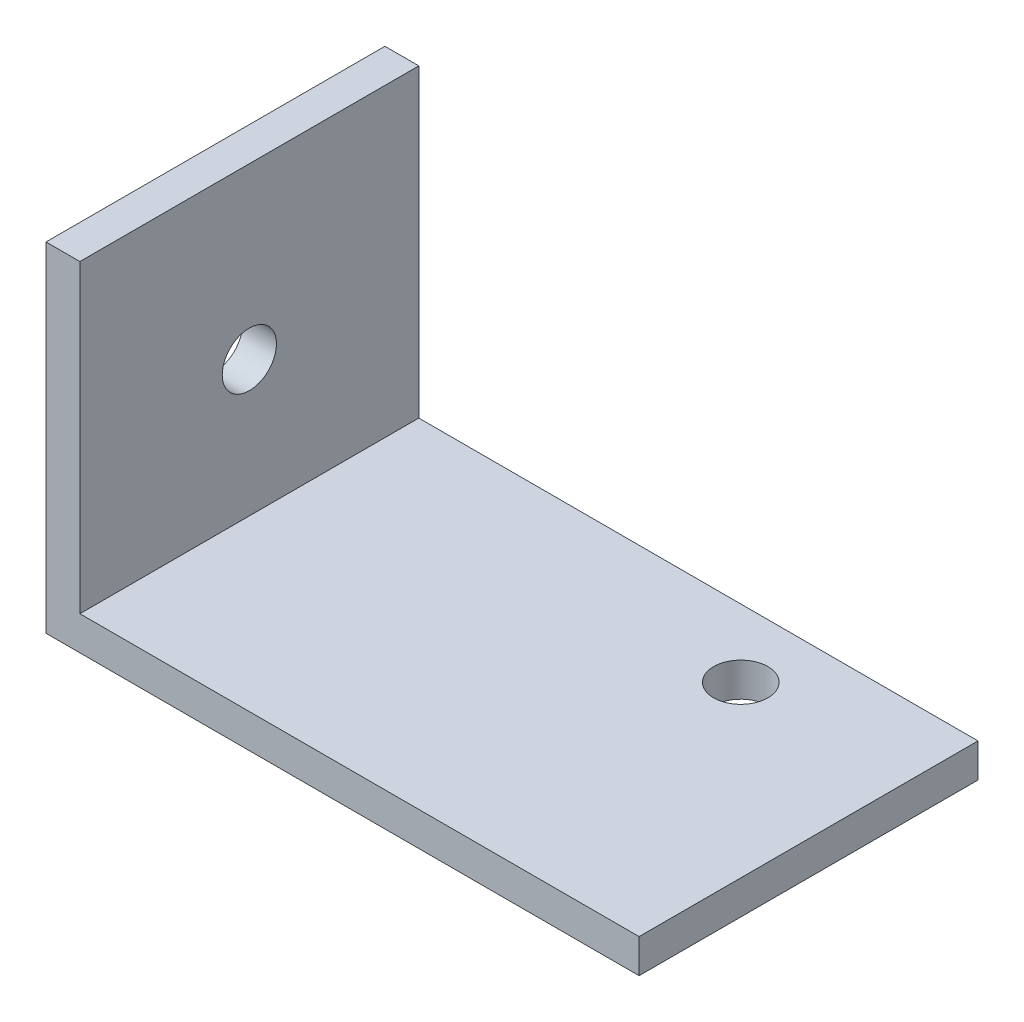
ISO-10303-21;
HEADER;
FILE_DESCRIPTION(('STEP AP214'),'2;1');
FILE_NAME('part.step','',(''),(''),'','','');
FILE_SCHEMA(('AUTOMOTIVE_DESIGN { 1 0 10303 214 1 1 1 1 }'));
ENDSEC;
DATA;
#1=APPLICATION_CONTEXT('core data for automotive mechanical design processes');
#2=APPLICATION_PROTOCOL_DEFINITION('international standard','automotive_design',2000,#1);
#3=PRODUCT_CONTEXT('',#1,'mechanical');
#4=PRODUCT('Part','Part','',(#3));
#5=PRODUCT_RELATED_PRODUCT_CATEGORY('part','',(#4));
#6=PRODUCT_DEFINITION_FORMATION('','',#4);
#7=PRODUCT_DEFINITION_CONTEXT('part definition',#1,'design');
#8=PRODUCT_DEFINITION('design','',#6,#7);
#9=PRODUCT_DEFINITION_SHAPE('','',#8);
#10=(LENGTH_UNIT() NAMED_UNIT(*) SI_UNIT(.MILLI.,.METRE.));
#11=(NAMED_UNIT(*) PLANE_ANGLE_UNIT() SI_UNIT($,.RADIAN.));
#12=(NAMED_UNIT(*) SI_UNIT($,.STERADIAN.) SOLID_ANGLE_UNIT());
#13=UNCERTAINTY_MEASURE_WITH_UNIT(LENGTH_MEASURE(1.E-05),#10,'distance_accuracy_value','');
#14=(GEOMETRIC_REPRESENTATION_CONTEXT(3) GLOBAL_UNCERTAINTY_ASSIGNED_CONTEXT((#13)) GLOBAL_UNIT_ASSIGNED_CONTEXT((#10,
#11,#12)) REPRESENTATION_CONTEXT('',''));
#15=CARTESIAN_POINT('',(0.,0.,0.));
#16=DIRECTION('',(0.,0.,1.));
#17=DIRECTION('',(1.,0.,0.));
#18=AXIS2_PLACEMENT_3D('',#15,#16,#17);
#19=CARTESIAN_POINT('',(0.,20.,20.));
#20=DIRECTION('',(1.,0.,0.));
#21=DIRECTION('',(0.,1.,0.));
#22=AXIS2_PLACEMENT_3D('',#19,#20,#21);
#23=PLANE('',#22);
#24=CARTESIAN_POINT('',(0.,10.,10.));
#25=DIRECTION('',(-1.,0.,0.));
#26=DIRECTION('',(0.,-1.,0.));
#27=AXIS2_PLACEMENT_3D('',#24,#25,#26);
#28=CIRCLE('',#27,1.6);
#29=CARTESIAN_POINT('',(0.,8.4,10.));
#30=VERTEX_POINT('',#29);
#31=EDGE_CURVE('E147',#30,#30,#28,.T.);
#32=ORIENTED_EDGE('',*,*,#31,.F.);
#33=EDGE_LOOP('',(#32));
#34=FACE_BOUND('',#33,.T.);
#35=DIRECTION('',(0.,-1.,0.));
#36=VECTOR('',#35,1.);
#37=CARTESIAN_POINT('',(0.,20.,0.));
#38=LINE('',#37,#36);
#39=CARTESIAN_POINT('',(0.,20.,0.));
#40=VERTEX_POINT('',#39);
#41=CARTESIAN_POINT('',(0.,0.,0.));
#42=VERTEX_POINT('',#41);
#43=EDGE_CURVE('E122',#40,#42,#38,.T.);
#44=ORIENTED_EDGE('',*,*,#43,.T.);
#45=DIRECTION('',(0.,0.,-1.));
#46=VECTOR('',#45,1.);
#47=CARTESIAN_POINT('',(0.,0.,20.));
#48=LINE('',#47,#46);
#49=CARTESIAN_POINT('',(0.,0.,20.));
#50=VERTEX_POINT('',#49);
#51=EDGE_CURVE('E11',#50,#42,#48,.T.);
#52=ORIENTED_EDGE('',*,*,#51,.F.);
#53=DIRECTION('',(0.,-1.,0.));
#54=VECTOR('',#53,1.);
#55=CARTESIAN_POINT('',(0.,20.,20.));
#56=LINE('',#55,#54);
#57=CARTESIAN_POINT('',(0.,20.,20.));
#58=VERTEX_POINT('',#57);
#59=EDGE_CURVE('E133',#58,#50,#56,.T.);
#60=ORIENTED_EDGE('',*,*,#59,.F.);
#61=DIRECTION('',(0.,0.,-1.));
#62=VECTOR('',#61,1.);
#63=CARTESIAN_POINT('',(0.,20.,20.));
#64=LINE('',#63,#62);
#65=EDGE_CURVE('E118',#58,#40,#64,.T.);
#66=ORIENTED_EDGE('',*,*,#65,.T.);
#67=EDGE_LOOP('',(#44,#52,#60,#66));
#68=FACE_BOUND('',#67,.T.);
#69=ADVANCED_FACE('F36',(#34,#68),#23,.F.);
#70=CARTESIAN_POINT('',(0.,0.,20.));
#71=DIRECTION('',(0.,1.,0.));
#72=DIRECTION('',(0.,0.,1.));
#73=AXIS2_PLACEMENT_3D('',#70,#71,#72);
#74=PLANE('',#73);
#75=CARTESIAN_POINT('',(25.,0.,4.));
#76=DIRECTION('',(0.,-1.,0.));
#77=DIRECTION('',(0.,0.,-1.));
#78=AXIS2_PLACEMENT_3D('',#75,#76,#77);
#79=CIRCLE('',#78,1.6);
#80=CARTESIAN_POINT('',(25.,0.,2.4));
#81=VERTEX_POINT('',#80);
#82=EDGE_CURVE('E139',#81,#81,#79,.T.);
#83=ORIENTED_EDGE('',*,*,#82,.F.);
#84=EDGE_LOOP('',(#83));
#85=FACE_BOUND('',#84,.T.);
#86=DIRECTION('',(1.,0.,0.));
#87=VECTOR('',#86,1.);
#88=CARTESIAN_POINT('',(0.,0.,0.));
#89=LINE('',#88,#87);
#90=CARTESIAN_POINT('',(35.,0.,0.));
#91=VERTEX_POINT('',#90);
#92=EDGE_CURVE('E125',#42,#91,#89,.T.);
#93=ORIENTED_EDGE('',*,*,#92,.T.);
#94=DIRECTION('',(0.,0.,-1.));
#95=VECTOR('',#94,1.);
#96=CARTESIAN_POINT('',(35.,0.,20.));
#97=LINE('',#96,#95);
#98=CARTESIAN_POINT('',(35.,0.,20.));
#99=VERTEX_POINT('',#98);
#100=EDGE_CURVE('E45',#99,#91,#97,.T.);
#101=ORIENTED_EDGE('',*,*,#100,.F.);
#102=DIRECTION('',(1.,0.,0.));
#103=VECTOR('',#102,1.);
#104=CARTESIAN_POINT('',(0.,0.,20.));
#105=LINE('',#104,#103);
#106=EDGE_CURVE('E91',#50,#99,#105,.T.);
#107=ORIENTED_EDGE('',*,*,#106,.F.);
#108=ORIENTED_EDGE('',*,*,#51,.T.);
#109=EDGE_LOOP('',(#93,#101,#107,#108));
#110=FACE_BOUND('',#109,.T.);
#111=ADVANCED_FACE('F153',(#85,#110),#74,.F.);
#112=CARTESIAN_POINT('',(35.,0.,20.));
#113=DIRECTION('',(-1.,0.,0.));
#114=DIRECTION('',(0.,0.,1.));
#115=AXIS2_PLACEMENT_3D('',#112,#113,#114);
#116=PLANE('',#115);
#117=DIRECTION('',(0.,1.,0.));
#118=VECTOR('',#117,1.);
#119=CARTESIAN_POINT('',(35.,0.,0.));
#120=LINE('',#119,#118);
#121=CARTESIAN_POINT('',(35.,2.,0.));
#122=VERTEX_POINT('',#121);
#123=EDGE_CURVE('E128',#91,#122,#120,.T.);
#124=ORIENTED_EDGE('',*,*,#123,.T.);
#125=DIRECTION('',(0.,0.,-1.));
#126=VECTOR('',#125,1.);
#127=CARTESIAN_POINT('',(35.,2.,20.));
#128=LINE('',#127,#126);
#129=CARTESIAN_POINT('',(35.,2.,20.));
#130=VERTEX_POINT('',#129);
#131=EDGE_CURVE('E113',#130,#122,#128,.T.);
#132=ORIENTED_EDGE('',*,*,#131,.F.);
#133=DIRECTION('',(0.,1.,0.));
#134=VECTOR('',#133,1.);
#135=CARTESIAN_POINT('',(35.,0.,20.));
#136=LINE('',#135,#134);
#137=EDGE_CURVE('E104',#99,#130,#136,.T.);
#138=ORIENTED_EDGE('',*,*,#137,.F.);
#139=ORIENTED_EDGE('',*,*,#100,.T.);
#140=EDGE_LOOP('',(#124,#132,#138,#139));
#141=FACE_BOUND('',#140,.T.);
#142=ADVANCED_FACE('F156',(#141),#116,.F.);
#143=CARTESIAN_POINT('',(35.,2.,20.));
#144=DIRECTION('',(0.,-1.,0.));
#145=DIRECTION('',(1.,0.,0.));
#146=AXIS2_PLACEMENT_3D('',#143,#144,#145);
#147=PLANE('',#146);
#148=CARTESIAN_POINT('',(25.,2.,4.));
#149=DIRECTION('',(0.,-1.,0.));
#150=DIRECTION('',(1.,0.,0.));
#151=AXIS2_PLACEMENT_3D('',#148,#149,#150);
#152=CIRCLE('',#151,1.6);
#153=CARTESIAN_POINT('',(26.6,2.,4.));
#154=VERTEX_POINT('',#153);
#155=EDGE_CURVE('E126',#154,#154,#152,.T.);
#156=ORIENTED_EDGE('',*,*,#155,.T.);
#157=EDGE_LOOP('',(#156));
#158=FACE_BOUND('',#157,.T.);
#159=DIRECTION('',(-1.,0.,0.));
#160=VECTOR('',#159,1.);
#161=CARTESIAN_POINT('',(35.,2.,0.));
#162=LINE('',#161,#160);
#163=CARTESIAN_POINT('',(2.,2.,0.));
#164=VERTEX_POINT('',#163);
#165=EDGE_CURVE('E112',#122,#164,#162,.T.);
#166=ORIENTED_EDGE('',*,*,#165,.T.);
#167=DIRECTION('',(0.,0.,-1.));
#168=VECTOR('',#167,1.);
#169=CARTESIAN_POINT('',(2.,2.,20.));
#170=LINE('',#169,#168);
#171=CARTESIAN_POINT('',(2.,2.,20.));
#172=VERTEX_POINT('',#171);
#173=EDGE_CURVE('E109',#172,#164,#170,.T.);
#174=ORIENTED_EDGE('',*,*,#173,.F.);
#175=DIRECTION('',(-1.,0.,0.));
#176=VECTOR('',#175,1.);
#177=CARTESIAN_POINT('',(35.,2.,20.));
#178=LINE('',#177,#176);
#179=EDGE_CURVE('E98',#130,#172,#178,.T.);
#180=ORIENTED_EDGE('',*,*,#179,.F.);
#181=ORIENTED_EDGE('',*,*,#131,.T.);
#182=EDGE_LOOP('',(#166,#174,#180,#181));
#183=FACE_BOUND('',#182,.T.);
#184=ADVANCED_FACE('F110',(#158,#183),#147,.F.);
#185=CARTESIAN_POINT('',(2.,2.,20.));
#186=DIRECTION('',(-1.,0.,0.));
#187=DIRECTION('',(0.,0.,1.));
#188=AXIS2_PLACEMENT_3D('',#185,#186,#187);
#189=PLANE('',#188);
#190=CARTESIAN_POINT('',(2.,10.,10.));
#191=DIRECTION('',(-1.,0.,0.));
#192=DIRECTION('',(0.,0.,1.));
#193=AXIS2_PLACEMENT_3D('',#190,#191,#192);
#194=CIRCLE('',#193,1.6);
#195=CARTESIAN_POINT('',(2.,10.,11.6));
#196=VERTEX_POINT('',#195);
#197=EDGE_CURVE('E39',#196,#196,#194,.T.);
#198=ORIENTED_EDGE('',*,*,#197,.T.);
#199=EDGE_LOOP('',(#198));
#200=FACE_BOUND('',#199,.T.);
#201=DIRECTION('',(0.,1.,0.));
#202=VECTOR('',#201,1.);
#203=CARTESIAN_POINT('',(2.,2.,0.));
#204=LINE('',#203,#202);
#205=CARTESIAN_POINT('',(2.,20.,0.));
#206=VERTEX_POINT('',#205);
#207=EDGE_CURVE('E77',#164,#206,#204,.T.);
#208=ORIENTED_EDGE('',*,*,#207,.T.);
#209=DIRECTION('',(0.,0.,-1.));
#210=VECTOR('',#209,1.);
#211=CARTESIAN_POINT('',(2.,20.,20.));
#212=LINE('',#211,#210);
#213=CARTESIAN_POINT('',(2.,20.,20.));
#214=VERTEX_POINT('',#213);
#215=EDGE_CURVE('E114',#214,#206,#212,.T.);
#216=ORIENTED_EDGE('',*,*,#215,.F.);
#217=DIRECTION('',(0.,1.,0.));
#218=VECTOR('',#217,1.);
#219=CARTESIAN_POINT('',(2.,2.,20.));
#220=LINE('',#219,#218);
#221=EDGE_CURVE('E102',#172,#214,#220,.T.);
#222=ORIENTED_EDGE('',*,*,#221,.F.);
#223=ORIENTED_EDGE('',*,*,#173,.T.);
#224=EDGE_LOOP('',(#208,#216,#222,#223));
#225=FACE_BOUND('',#224,.T.);
#226=ADVANCED_FACE('F116',(#200,#225),#189,.F.);
#227=CARTESIAN_POINT('',(2.,20.,20.));
#228=DIRECTION('',(0.,-1.,0.));
#229=DIRECTION('',(0.,0.,-1.));
#230=AXIS2_PLACEMENT_3D('',#227,#228,#229);
#231=PLANE('',#230);
#232=DIRECTION('',(-1.,0.,0.));
#233=VECTOR('',#232,1.);
#234=CARTESIAN_POINT('',(2.,20.,0.));
#235=LINE('',#234,#233);
#236=EDGE_CURVE('E83',#206,#40,#235,.T.);
#237=ORIENTED_EDGE('',*,*,#236,.T.);
#238=ORIENTED_EDGE('',*,*,#65,.F.);
#239=DIRECTION('',(-1.,0.,0.));
#240=VECTOR('',#239,1.);
#241=CARTESIAN_POINT('',(2.,20.,20.));
#242=LINE('',#241,#240);
#243=EDGE_CURVE('E54',#214,#58,#242,.T.);
#244=ORIENTED_EDGE('',*,*,#243,.F.);
#245=ORIENTED_EDGE('',*,*,#215,.T.);
#246=EDGE_LOOP('',(#237,#238,#244,#245));
#247=FACE_BOUND('',#246,.T.);
#248=ADVANCED_FACE('F161',(#247),#231,.F.);
#249=CARTESIAN_POINT('',(0.,0.,20.));
#250=DIRECTION('',(0.,0.,1.));
#251=DIRECTION('',(1.,0.,0.));
#252=AXIS2_PLACEMENT_3D('',#249,#250,#251);
#253=PLANE('',#252);
#254=ORIENTED_EDGE('',*,*,#59,.T.);
#255=ORIENTED_EDGE('',*,*,#106,.T.);
#256=ORIENTED_EDGE('',*,*,#137,.T.);
#257=ORIENTED_EDGE('',*,*,#179,.T.);
#258=ORIENTED_EDGE('',*,*,#221,.T.);
#259=ORIENTED_EDGE('',*,*,#243,.T.);
#260=EDGE_LOOP('',(#254,#255,#256,#257,#258,#259));
#261=FACE_BOUND('',#260,.T.);
#262=ADVANCED_FACE('F100',(#261),#253,.T.);
#263=CARTESIAN_POINT('',(0.,0.,0.));
#264=DIRECTION('',(0.,0.,1.));
#265=DIRECTION('',(1.,0.,0.));
#266=AXIS2_PLACEMENT_3D('',#263,#264,#265);
#267=PLANE('',#266);
#268=ORIENTED_EDGE('',*,*,#43,.F.);
#269=ORIENTED_EDGE('',*,*,#236,.F.);
#270=ORIENTED_EDGE('',*,*,#207,.F.);
#271=ORIENTED_EDGE('',*,*,#165,.F.);
#272=ORIENTED_EDGE('',*,*,#123,.F.);
#273=ORIENTED_EDGE('',*,*,#92,.F.);
#274=EDGE_LOOP('',(#268,#269,#270,#271,#272,#273));
#275=FACE_BOUND('',#274,.T.);
#276=ADVANCED_FACE('F159',(#275),#267,.F.);
#277=CARTESIAN_POINT('',(25.,20.,4.));
#278=DIRECTION('',(0.,-1.,0.));
#279=DIRECTION('',(0.,0.,-1.));
#280=AXIS2_PLACEMENT_3D('',#277,#278,#279);
#281=CYLINDRICAL_SURFACE('',#280,1.6);
#282=ORIENTED_EDGE('',*,*,#82,.T.);
#283=EDGE_LOOP('',(#282));
#284=FACE_BOUND('',#283,.T.);
#285=ORIENTED_EDGE('',*,*,#155,.F.);
#286=EDGE_LOOP('',(#285));
#287=FACE_BOUND('',#286,.T.);
#288=ADVANCED_FACE('F184',(#284,#287),#281,.F.);
#289=CARTESIAN_POINT('',(35.,10.,10.));
#290=DIRECTION('',(-1.,0.,0.));
#291=DIRECTION('',(0.,-1.,0.));
#292=AXIS2_PLACEMENT_3D('',#289,#290,#291);
#293=CYLINDRICAL_SURFACE('',#292,1.6);
#294=ORIENTED_EDGE('',*,*,#31,.T.);
#295=EDGE_LOOP('',(#294));
#296=FACE_BOUND('',#295,.T.);
#297=ORIENTED_EDGE('',*,*,#197,.F.);
#298=EDGE_LOOP('',(#297));
#299=FACE_BOUND('',#298,.T.);
#300=ADVANCED_FACE('F181',(#296,#299),#293,.F.);
#301=CLOSED_SHELL('',(#69,#111,#142,#184,#226,#248,#262,#276,#288,#300));
#302=MANIFOLD_SOLID_BREP('B2',#301);
#303=ADVANCED_BREP_SHAPE_REPRESENTATION('',(#18,#302),#14);
#304=SHAPE_DEFINITION_REPRESENTATION(#9,#303);
ENDSEC;
END-ISO-10303-21;
